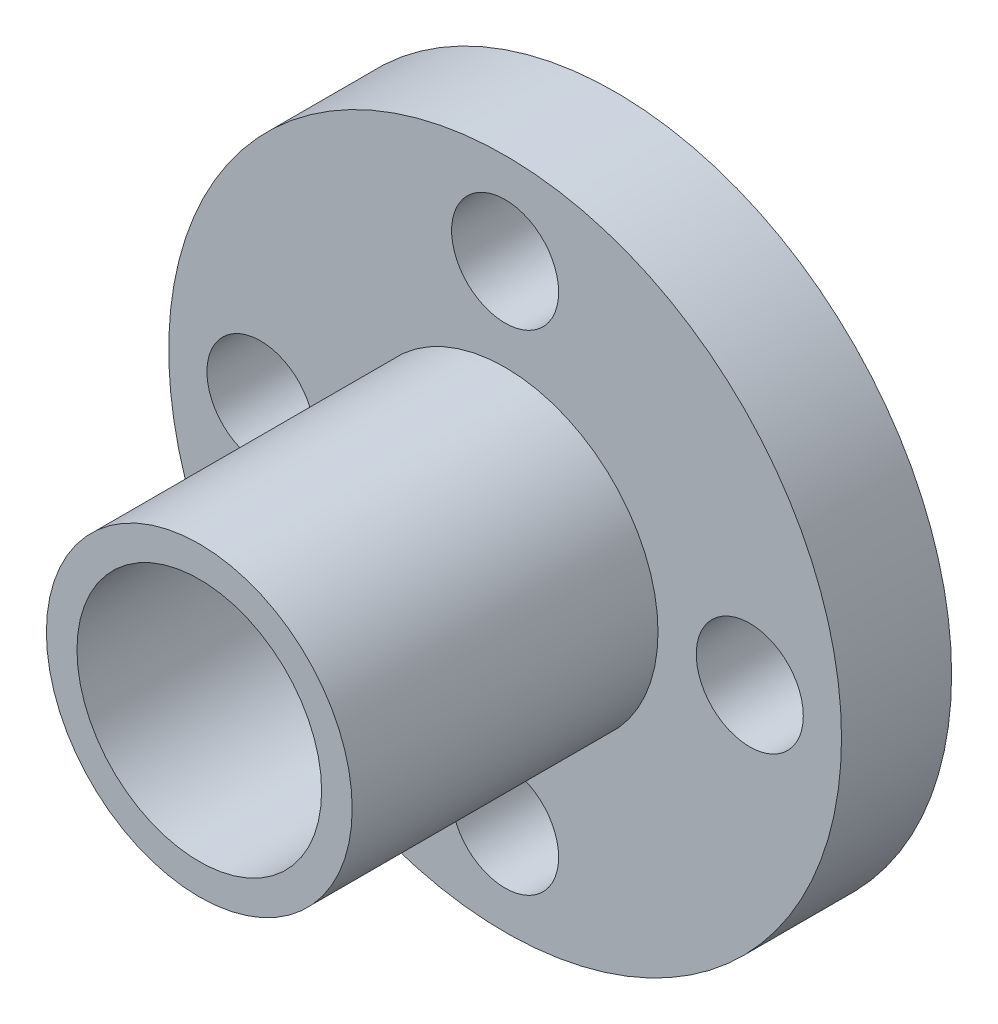
ISO-10303-21;
HEADER;
FILE_DESCRIPTION(('STEP AP214'),'2;1');
FILE_NAME('part.step','',(''),(''),'','','');
FILE_SCHEMA(('AUTOMOTIVE_DESIGN { 1 0 10303 214 1 1 1 1 }'));
ENDSEC;
DATA;
#1=APPLICATION_CONTEXT('core data for automotive mechanical design processes');
#2=APPLICATION_PROTOCOL_DEFINITION('international standard','automotive_design',2000,#1);
#3=PRODUCT_CONTEXT('',#1,'mechanical');
#4=PRODUCT('Part','Part','',(#3));
#5=PRODUCT_RELATED_PRODUCT_CATEGORY('part','',(#4));
#6=PRODUCT_DEFINITION_FORMATION('','',#4);
#7=PRODUCT_DEFINITION_CONTEXT('part definition',#1,'design');
#8=PRODUCT_DEFINITION('design','',#6,#7);
#9=PRODUCT_DEFINITION_SHAPE('','',#8);
#10=(LENGTH_UNIT() NAMED_UNIT(*) SI_UNIT(.MILLI.,.METRE.));
#11=(NAMED_UNIT(*) PLANE_ANGLE_UNIT() SI_UNIT($,.RADIAN.));
#12=(NAMED_UNIT(*) SI_UNIT($,.STERADIAN.) SOLID_ANGLE_UNIT());
#13=UNCERTAINTY_MEASURE_WITH_UNIT(LENGTH_MEASURE(1.E-05),#10,'distance_accuracy_value','');
#14=(GEOMETRIC_REPRESENTATION_CONTEXT(3) GLOBAL_UNCERTAINTY_ASSIGNED_CONTEXT((#13)) GLOBAL_UNIT_ASSIGNED_CONTEXT((#10,
#11,#12)) REPRESENTATION_CONTEXT('',''));
#15=CARTESIAN_POINT('',(0.,0.,0.));
#16=DIRECTION('',(0.,0.,1.));
#17=DIRECTION('',(1.,0.,0.));
#18=AXIS2_PLACEMENT_3D('',#15,#16,#17);
#19=CARTESIAN_POINT('',(0.,0.,3.6));
#20=DIRECTION('',(0.,0.,1.));
#21=DIRECTION('',(1.,0.,0.));
#22=AXIS2_PLACEMENT_3D('',#19,#20,#21);
#23=PLANE('',#22);
#24=CARTESIAN_POINT('',(0.,0.,3.6));
#25=DIRECTION('',(0.,0.,1.));
#26=DIRECTION('',(1.,0.,0.));
#27=AXIS2_PLACEMENT_3D('',#24,#25,#26);
#28=CIRCLE('',#27,5.);
#29=CARTESIAN_POINT('',(5.,0.,3.6));
#30=VERTEX_POINT('',#29);
#31=EDGE_CURVE('E13',#30,#30,#28,.T.);
#32=ORIENTED_EDGE('',*,*,#31,.F.);
#33=EDGE_LOOP('',(#32));
#34=FACE_BOUND('',#33,.T.);
#35=CARTESIAN_POINT('',(0.,-8.,3.6));
#36=DIRECTION('',(0.,0.,1.));
#37=DIRECTION('',(1.,0.,0.));
#38=AXIS2_PLACEMENT_3D('',#35,#36,#37);
#39=CIRCLE('',#38,1.75000000000005);
#40=CARTESIAN_POINT('',(1.75000000000005,-8.,3.6));
#41=VERTEX_POINT('',#40);
#42=EDGE_CURVE('E84',#41,#41,#39,.T.);
#43=ORIENTED_EDGE('',*,*,#42,.F.);
#44=EDGE_LOOP('',(#43));
#45=FACE_BOUND('',#44,.T.);
#46=CARTESIAN_POINT('',(0.,8.,3.6));
#47=DIRECTION('',(0.,0.,1.));
#48=DIRECTION('',(1.,0.,0.));
#49=AXIS2_PLACEMENT_3D('',#46,#47,#48);
#50=CIRCLE('',#49,1.75);
#51=CARTESIAN_POINT('',(1.75,8.,3.6));
#52=VERTEX_POINT('',#51);
#53=EDGE_CURVE('E96',#52,#52,#50,.T.);
#54=ORIENTED_EDGE('',*,*,#53,.F.);
#55=EDGE_LOOP('',(#54));
#56=FACE_BOUND('',#55,.T.);
#57=CARTESIAN_POINT('',(0.,0.,3.6));
#58=DIRECTION('',(0.,0.,1.));
#59=DIRECTION('',(1.,0.,0.));
#60=AXIS2_PLACEMENT_3D('',#57,#58,#59);
#61=CIRCLE('',#60,11.);
#62=CARTESIAN_POINT('',(11.,0.,3.6));
#63=VERTEX_POINT('',#62);
#64=EDGE_CURVE('E66',#63,#63,#61,.T.);
#65=ORIENTED_EDGE('',*,*,#64,.T.);
#66=EDGE_LOOP('',(#65));
#67=FACE_BOUND('',#66,.T.);
#68=CARTESIAN_POINT('',(8.,0.,3.6));
#69=DIRECTION('',(0.,0.,1.));
#70=DIRECTION('',(1.,0.,0.));
#71=AXIS2_PLACEMENT_3D('',#68,#69,#70);
#72=CIRCLE('',#71,1.75000000000003);
#73=CARTESIAN_POINT('',(9.75000000000003,0.,3.6));
#74=VERTEX_POINT('',#73);
#75=EDGE_CURVE('E90',#74,#74,#72,.T.);
#76=ORIENTED_EDGE('',*,*,#75,.F.);
#77=EDGE_LOOP('',(#76));
#78=FACE_BOUND('',#77,.T.);
#79=CARTESIAN_POINT('',(-8.,0.,3.6));
#80=DIRECTION('',(0.,0.,1.));
#81=DIRECTION('',(1.,0.,0.));
#82=AXIS2_PLACEMENT_3D('',#79,#80,#81);
#83=CIRCLE('',#82,1.75000000000008);
#84=CARTESIAN_POINT('',(-6.24999999999992,0.,3.6));
#85=VERTEX_POINT('',#84);
#86=EDGE_CURVE('E77',#85,#85,#83,.T.);
#87=ORIENTED_EDGE('',*,*,#86,.F.);
#88=EDGE_LOOP('',(#87));
#89=FACE_BOUND('',#88,.T.);
#90=ADVANCED_FACE('F58',(#34,#45,#56,#67,#78,#89),#23,.T.);
#91=CARTESIAN_POINT('',(0.,0.,0.));
#92=DIRECTION('',(0.,0.,1.));
#93=DIRECTION('',(1.,0.,0.));
#94=AXIS2_PLACEMENT_3D('',#91,#92,#93);
#95=PLANE('',#94);
#96=CARTESIAN_POINT('',(0.,0.,0.));
#97=DIRECTION('',(0.,0.,1.));
#98=DIRECTION('',(1.,0.,0.));
#99=AXIS2_PLACEMENT_3D('',#96,#97,#98);
#100=CIRCLE('',#99,5.);
#101=CARTESIAN_POINT('',(5.,0.,0.));
#102=VERTEX_POINT('',#101);
#103=EDGE_CURVE('E62',#102,#102,#100,.T.);
#104=ORIENTED_EDGE('',*,*,#103,.T.);
#105=EDGE_LOOP('',(#104));
#106=FACE_BOUND('',#105,.T.);
#107=CARTESIAN_POINT('',(0.,0.,0.));
#108=DIRECTION('',(0.,0.,1.));
#109=DIRECTION('',(1.,0.,0.));
#110=AXIS2_PLACEMENT_3D('',#107,#108,#109);
#111=CIRCLE('',#110,11.);
#112=CARTESIAN_POINT('',(11.,0.,0.));
#113=VERTEX_POINT('',#112);
#114=EDGE_CURVE('E71',#113,#113,#111,.T.);
#115=ORIENTED_EDGE('',*,*,#114,.F.);
#116=EDGE_LOOP('',(#115));
#117=FACE_BOUND('',#116,.T.);
#118=CARTESIAN_POINT('',(0.,8.,0.));
#119=DIRECTION('',(0.,0.,1.));
#120=DIRECTION('',(1.,0.,0.));
#121=AXIS2_PLACEMENT_3D('',#118,#119,#120);
#122=CIRCLE('',#121,1.75);
#123=CARTESIAN_POINT('',(1.75,8.,0.));
#124=VERTEX_POINT('',#123);
#125=EDGE_CURVE('E93',#124,#124,#122,.T.);
#126=ORIENTED_EDGE('',*,*,#125,.T.);
#127=EDGE_LOOP('',(#126));
#128=FACE_BOUND('',#127,.T.);
#129=CARTESIAN_POINT('',(8.,0.,0.));
#130=DIRECTION('',(0.,0.,1.));
#131=DIRECTION('',(1.,0.,0.));
#132=AXIS2_PLACEMENT_3D('',#129,#130,#131);
#133=CIRCLE('',#132,1.75000000000003);
#134=CARTESIAN_POINT('',(9.75000000000003,0.,0.));
#135=VERTEX_POINT('',#134);
#136=EDGE_CURVE('E87',#135,#135,#133,.T.);
#137=ORIENTED_EDGE('',*,*,#136,.T.);
#138=EDGE_LOOP('',(#137));
#139=FACE_BOUND('',#138,.T.);
#140=CARTESIAN_POINT('',(0.,-8.,0.));
#141=DIRECTION('',(0.,0.,1.));
#142=DIRECTION('',(1.,0.,0.));
#143=AXIS2_PLACEMENT_3D('',#140,#141,#142);
#144=CIRCLE('',#143,1.75000000000005);
#145=CARTESIAN_POINT('',(1.75000000000005,-8.,0.));
#146=VERTEX_POINT('',#145);
#147=EDGE_CURVE('E80',#146,#146,#144,.T.);
#148=ORIENTED_EDGE('',*,*,#147,.T.);
#149=EDGE_LOOP('',(#148));
#150=FACE_BOUND('',#149,.T.);
#151=CARTESIAN_POINT('',(-8.,0.,0.));
#152=DIRECTION('',(0.,0.,1.));
#153=DIRECTION('',(1.,0.,0.));
#154=AXIS2_PLACEMENT_3D('',#151,#152,#153);
#155=CIRCLE('',#154,1.75000000000008);
#156=CARTESIAN_POINT('',(-6.24999999999992,0.,0.));
#157=VERTEX_POINT('',#156);
#158=EDGE_CURVE('E81',#157,#157,#155,.T.);
#159=ORIENTED_EDGE('',*,*,#158,.T.);
#160=EDGE_LOOP('',(#159));
#161=FACE_BOUND('',#160,.T.);
#162=ADVANCED_FACE('F104',(#106,#117,#128,#139,#150,#161),#95,.F.);
#163=CARTESIAN_POINT('',(0.,0.,3.6));
#164=DIRECTION('',(0.,0.,-1.));
#165=DIRECTION('',(-1.,0.,0.));
#166=AXIS2_PLACEMENT_3D('',#163,#164,#165);
#167=CYLINDRICAL_SURFACE('',#166,11.);
#168=ORIENTED_EDGE('',*,*,#64,.F.);
#169=EDGE_LOOP('',(#168));
#170=FACE_BOUND('',#169,.T.);
#171=ORIENTED_EDGE('',*,*,#114,.T.);
#172=EDGE_LOOP('',(#171));
#173=FACE_BOUND('',#172,.T.);
#174=ADVANCED_FACE('F60',(#170,#173),#167,.T.);
#175=CARTESIAN_POINT('',(0.,8.,3.6));
#176=DIRECTION('',(0.,0.,-1.));
#177=DIRECTION('',(-1.,0.,0.));
#178=AXIS2_PLACEMENT_3D('',#175,#176,#177);
#179=CYLINDRICAL_SURFACE('',#178,1.75);
#180=ORIENTED_EDGE('',*,*,#53,.T.);
#181=EDGE_LOOP('',(#180));
#182=FACE_BOUND('',#181,.T.);
#183=ORIENTED_EDGE('',*,*,#125,.F.);
#184=EDGE_LOOP('',(#183));
#185=FACE_BOUND('',#184,.T.);
#186=ADVANCED_FACE('F140',(#182,#185),#179,.F.);
#187=CARTESIAN_POINT('',(8.,0.,3.6));
#188=DIRECTION('',(0.,0.,-1.));
#189=DIRECTION('',(-1.,0.,0.));
#190=AXIS2_PLACEMENT_3D('',#187,#188,#189);
#191=CYLINDRICAL_SURFACE('',#190,1.75000000000003);
#192=ORIENTED_EDGE('',*,*,#75,.T.);
#193=EDGE_LOOP('',(#192));
#194=FACE_BOUND('',#193,.T.);
#195=ORIENTED_EDGE('',*,*,#136,.F.);
#196=EDGE_LOOP('',(#195));
#197=FACE_BOUND('',#196,.T.);
#198=ADVANCED_FACE('F130',(#194,#197),#191,.F.);
#199=CARTESIAN_POINT('',(0.,-8.,3.6));
#200=DIRECTION('',(0.,0.,-1.));
#201=DIRECTION('',(-1.,0.,0.));
#202=AXIS2_PLACEMENT_3D('',#199,#200,#201);
#203=CYLINDRICAL_SURFACE('',#202,1.75000000000005);
#204=ORIENTED_EDGE('',*,*,#42,.T.);
#205=EDGE_LOOP('',(#204));
#206=FACE_BOUND('',#205,.T.);
#207=ORIENTED_EDGE('',*,*,#147,.F.);
#208=EDGE_LOOP('',(#207));
#209=FACE_BOUND('',#208,.T.);
#210=ADVANCED_FACE('F119',(#206,#209),#203,.F.);
#211=CARTESIAN_POINT('',(-8.,0.,3.6));
#212=DIRECTION('',(0.,0.,-1.));
#213=DIRECTION('',(-1.,0.,0.));
#214=AXIS2_PLACEMENT_3D('',#211,#212,#213);
#215=CYLINDRICAL_SURFACE('',#214,1.75000000000008);
#216=ORIENTED_EDGE('',*,*,#86,.T.);
#217=EDGE_LOOP('',(#216));
#218=FACE_BOUND('',#217,.T.);
#219=ORIENTED_EDGE('',*,*,#158,.F.);
#220=EDGE_LOOP('',(#219));
#221=FACE_BOUND('',#220,.T.);
#222=ADVANCED_FACE('F116',(#218,#221),#215,.F.);
#223=CARTESIAN_POINT('',(0.,0.,-1.5));
#224=DIRECTION('',(0.,0.,1.));
#225=DIRECTION('',(1.,0.,0.));
#226=AXIS2_PLACEMENT_3D('',#223,#224,#225);
#227=CYLINDRICAL_SURFACE('',#226,5.);
#228=CARTESIAN_POINT('',(0.,0.,-1.5));
#229=DIRECTION('',(0.,0.,1.));
#230=DIRECTION('',(1.,0.,0.));
#231=AXIS2_PLACEMENT_3D('',#228,#229,#230);
#232=CIRCLE('',#231,5.);
#233=CARTESIAN_POINT('',(5.,0.,-1.5));
#234=VERTEX_POINT('',#233);
#235=EDGE_CURVE('E75',#234,#234,#232,.T.);
#236=ORIENTED_EDGE('',*,*,#235,.T.);
#237=EDGE_LOOP('',(#236));
#238=FACE_BOUND('',#237,.T.);
#239=ORIENTED_EDGE('',*,*,#103,.F.);
#240=EDGE_LOOP('',(#239));
#241=FACE_BOUND('',#240,.T.);
#242=ADVANCED_FACE('F118',(#238,#241),#227,.T.);
#243=CARTESIAN_POINT('',(0.,0.,-1.5));
#244=DIRECTION('',(0.,0.,1.));
#245=DIRECTION('',(1.,0.,0.));
#246=AXIS2_PLACEMENT_3D('',#243,#244,#245);
#247=PLANE('',#246);
#248=CARTESIAN_POINT('',(0.,0.,-1.5));
#249=DIRECTION('',(0.,0.,1.));
#250=DIRECTION('',(1.,0.,0.));
#251=AXIS2_PLACEMENT_3D('',#248,#249,#250);
#252=CIRCLE('',#251,4.);
#253=CARTESIAN_POINT('',(4.,0.,-1.5));
#254=VERTEX_POINT('',#253);
#255=EDGE_CURVE('E227',#254,#254,#252,.T.);
#256=ORIENTED_EDGE('',*,*,#255,.T.);
#257=EDGE_LOOP('',(#256));
#258=FACE_BOUND('',#257,.T.);
#259=ORIENTED_EDGE('',*,*,#235,.F.);
#260=EDGE_LOOP('',(#259));
#261=FACE_BOUND('',#260,.T.);
#262=ADVANCED_FACE('F126',(#258,#261),#247,.F.);
#263=CARTESIAN_POINT('',(0.,0.,-1.5));
#264=DIRECTION('',(0.,0.,1.));
#265=DIRECTION('',(1.,0.,0.));
#266=AXIS2_PLACEMENT_3D('',#263,#264,#265);
#267=CYLINDRICAL_SURFACE('',#266,4.);
#268=ORIENTED_EDGE('',*,*,#255,.F.);
#269=EDGE_LOOP('',(#268));
#270=FACE_BOUND('',#269,.T.);
#271=CARTESIAN_POINT('',(0.,0.,13.6));
#272=DIRECTION('',(0.,0.,1.));
#273=DIRECTION('',(1.,0.,0.));
#274=AXIS2_PLACEMENT_3D('',#271,#272,#273);
#275=CIRCLE('',#274,4.);
#276=CARTESIAN_POINT('',(4.,0.,13.6));
#277=VERTEX_POINT('',#276);
#278=EDGE_CURVE('E230',#277,#277,#275,.T.);
#279=ORIENTED_EDGE('',*,*,#278,.T.);
#280=EDGE_LOOP('',(#279));
#281=FACE_BOUND('',#280,.T.);
#282=ADVANCED_FACE('F190',(#270,#281),#267,.F.);
#283=ORIENTED_EDGE('',*,*,#31,.T.);
#284=EDGE_LOOP('',(#283));
#285=FACE_BOUND('',#284,.T.);
#286=CARTESIAN_POINT('',(0.,0.,13.6));
#287=DIRECTION('',(0.,0.,1.));
#288=DIRECTION('',(1.,0.,0.));
#289=AXIS2_PLACEMENT_3D('',#286,#287,#288);
#290=CIRCLE('',#289,5.);
#291=CARTESIAN_POINT('',(5.,0.,13.6));
#292=VERTEX_POINT('',#291);
#293=EDGE_CURVE('E232',#292,#292,#290,.T.);
#294=ORIENTED_EDGE('',*,*,#293,.F.);
#295=EDGE_LOOP('',(#294));
#296=FACE_BOUND('',#295,.T.);
#297=ADVANCED_FACE('F129',(#285,#296),#227,.T.);
#298=CARTESIAN_POINT('',(0.,0.,13.6));
#299=DIRECTION('',(0.,0.,1.));
#300=DIRECTION('',(1.,0.,0.));
#301=AXIS2_PLACEMENT_3D('',#298,#299,#300);
#302=PLANE('',#301);
#303=ORIENTED_EDGE('',*,*,#293,.T.);
#304=EDGE_LOOP('',(#303));
#305=FACE_BOUND('',#304,.T.);
#306=ORIENTED_EDGE('',*,*,#278,.F.);
#307=EDGE_LOOP('',(#306));
#308=FACE_BOUND('',#307,.T.);
#309=ADVANCED_FACE('F202',(#305,#308),#302,.T.);
#310=CLOSED_SHELL('',(#90,#162,#174,#186,#198,#210,#222,#242,#262,#282,#297,#309));
#311=MANIFOLD_SOLID_BREP('B2',#310);
#312=ADVANCED_BREP_SHAPE_REPRESENTATION('',(#18,#311),#14);
#313=SHAPE_DEFINITION_REPRESENTATION(#9,#312);
ENDSEC;
END-ISO-10303-21;
